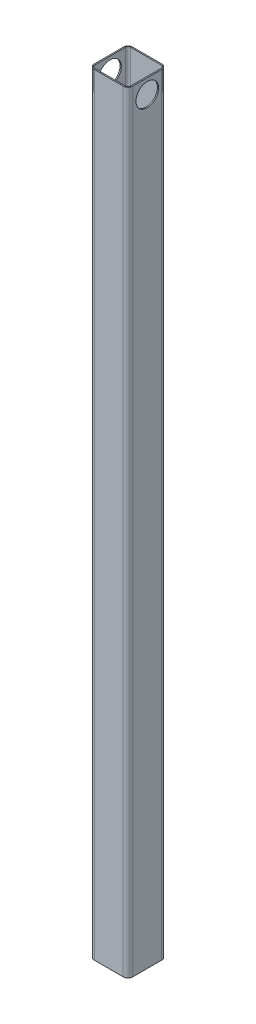
ISO-10303-21;
HEADER;
FILE_DESCRIPTION(('STEP AP214'),'2;1');
FILE_NAME('part.step','',(''),(''),'','','');
FILE_SCHEMA(('AUTOMOTIVE_DESIGN { 1 0 10303 214 1 1 1 1 }'));
ENDSEC;
DATA;
#1=APPLICATION_CONTEXT('core data for automotive mechanical design processes');
#2=APPLICATION_PROTOCOL_DEFINITION('international standard','automotive_design',2000,#1);
#3=PRODUCT_CONTEXT('',#1,'mechanical');
#4=PRODUCT('Part','Part','',(#3));
#5=PRODUCT_RELATED_PRODUCT_CATEGORY('part','',(#4));
#6=PRODUCT_DEFINITION_FORMATION('','',#4);
#7=PRODUCT_DEFINITION_CONTEXT('part definition',#1,'design');
#8=PRODUCT_DEFINITION('design','',#6,#7);
#9=PRODUCT_DEFINITION_SHAPE('','',#8);
#10=(LENGTH_UNIT() NAMED_UNIT(*) SI_UNIT(.MILLI.,.METRE.));
#11=(NAMED_UNIT(*) PLANE_ANGLE_UNIT() SI_UNIT($,.RADIAN.));
#12=(NAMED_UNIT(*) SI_UNIT($,.STERADIAN.) SOLID_ANGLE_UNIT());
#13=UNCERTAINTY_MEASURE_WITH_UNIT(LENGTH_MEASURE(1.E-05),#10,'distance_accuracy_value','');
#14=(GEOMETRIC_REPRESENTATION_CONTEXT(3) GLOBAL_UNCERTAINTY_ASSIGNED_CONTEXT((#13)) GLOBAL_UNIT_ASSIGNED_CONTEXT((#10,
#11,#12)) REPRESENTATION_CONTEXT('',''));
#15=CARTESIAN_POINT('',(0.,0.,0.));
#16=DIRECTION('',(0.,0.,1.));
#17=DIRECTION('',(1.,0.,0.));
#18=AXIS2_PLACEMENT_3D('',#15,#16,#17);
#19=CARTESIAN_POINT('',(28.575,762.,-28.575));
#20=DIRECTION('',(0.,1.,0.));
#21=DIRECTION('',(0.,0.,1.));
#22=AXIS2_PLACEMENT_3D('',#19,#20,#21);
#23=PLANE('',#22);
#24=CARTESIAN_POINT('',(28.575,762.,-28.575));
#25=DIRECTION('',(0.,1.,0.));
#26=DIRECTION('',(0.,0.,1.));
#27=AXIS2_PLACEMENT_3D('',#24,#25,#26);
#28=CIRCLE('',#27,9.525);
#29=CARTESIAN_POINT('',(38.1,762.,-28.575));
#30=VERTEX_POINT('',#29);
#31=CARTESIAN_POINT('',(28.575,762.,-38.1));
#32=VERTEX_POINT('',#31);
#33=EDGE_CURVE('E230',#30,#32,#28,.T.);
#34=ORIENTED_EDGE('',*,*,#33,.T.);
#35=DIRECTION('',(-1.,0.,0.));
#36=VECTOR('',#35,1.);
#37=CARTESIAN_POINT('',(28.575,762.,-38.1));
#38=LINE('',#37,#36);
#39=CARTESIAN_POINT('',(-28.575,762.,-38.1));
#40=VERTEX_POINT('',#39);
#41=EDGE_CURVE('E233',#32,#40,#38,.T.);
#42=ORIENTED_EDGE('',*,*,#41,.T.);
#43=CARTESIAN_POINT('',(-28.575,762.,-28.575));
#44=DIRECTION('',(0.,1.,0.));
#45=DIRECTION('',(0.,0.,1.));
#46=AXIS2_PLACEMENT_3D('',#43,#44,#45);
#47=CIRCLE('',#46,9.52499999999999);
#48=CARTESIAN_POINT('',(-38.1,762.,-28.575));
#49=VERTEX_POINT('',#48);
#50=EDGE_CURVE('E236',#40,#49,#47,.T.);
#51=ORIENTED_EDGE('',*,*,#50,.T.);
#52=DIRECTION('',(0.,0.,1.));
#53=VECTOR('',#52,1.);
#54=CARTESIAN_POINT('',(-38.1,762.,28.575));
#55=LINE('',#54,#53);
#56=CARTESIAN_POINT('',(-38.1,762.,28.575));
#57=VERTEX_POINT('',#56);
#58=EDGE_CURVE('E238',#49,#57,#55,.T.);
#59=ORIENTED_EDGE('',*,*,#58,.T.);
#60=CARTESIAN_POINT('',(-28.575,762.,28.575));
#61=DIRECTION('',(0.,1.,0.));
#62=DIRECTION('',(0.,0.,1.));
#63=AXIS2_PLACEMENT_3D('',#60,#61,#62);
#64=CIRCLE('',#63,9.525);
#65=CARTESIAN_POINT('',(-28.575,762.,38.1));
#66=VERTEX_POINT('',#65);
#67=EDGE_CURVE('E240',#57,#66,#64,.T.);
#68=ORIENTED_EDGE('',*,*,#67,.T.);
#69=DIRECTION('',(1.,0.,0.));
#70=VECTOR('',#69,1.);
#71=CARTESIAN_POINT('',(-28.575,762.,38.1));
#72=LINE('',#71,#70);
#73=CARTESIAN_POINT('',(28.575,762.,38.1));
#74=VERTEX_POINT('',#73);
#75=EDGE_CURVE('E242',#66,#74,#72,.T.);
#76=ORIENTED_EDGE('',*,*,#75,.T.);
#77=CARTESIAN_POINT('',(28.575,762.,28.575));
#78=DIRECTION('',(0.,1.,0.));
#79=DIRECTION('',(0.,0.,1.));
#80=AXIS2_PLACEMENT_3D('',#77,#78,#79);
#81=CIRCLE('',#80,9.525);
#82=CARTESIAN_POINT('',(38.1,762.,28.575));
#83=VERTEX_POINT('',#82);
#84=EDGE_CURVE('E244',#74,#83,#81,.T.);
#85=ORIENTED_EDGE('',*,*,#84,.T.);
#86=DIRECTION('',(0.,0.,-1.));
#87=VECTOR('',#86,1.);
#88=CARTESIAN_POINT('',(38.1,762.,-28.575));
#89=LINE('',#88,#87);
#90=EDGE_CURVE('E246',#83,#30,#89,.T.);
#91=ORIENTED_EDGE('',*,*,#90,.T.);
#92=EDGE_LOOP('',(#34,#42,#51,#59,#68,#76,#85,#91));
#93=FACE_BOUND('',#92,.T.);
#94=DIRECTION('',(0.,0.,1.));
#95=VECTOR('',#94,1.);
#96=CARTESIAN_POINT('',(-35.687,762.,30.9245));
#97=LINE('',#96,#95);
#98=CARTESIAN_POINT('',(-35.687,762.,-30.9245));
#99=VERTEX_POINT('',#98);
#100=CARTESIAN_POINT('',(-35.687,762.,30.9245));
#101=VERTEX_POINT('',#100);
#102=EDGE_CURVE('E163',#99,#101,#97,.T.);
#103=ORIENTED_EDGE('',*,*,#102,.F.);
#104=CARTESIAN_POINT('',(-30.9245,762.,-30.9245));
#105=DIRECTION('',(0.,1.,0.));
#106=DIRECTION('',(0.,0.,1.));
#107=AXIS2_PLACEMENT_3D('',#104,#105,#106);
#108=CIRCLE('',#107,4.7625);
#109=CARTESIAN_POINT('',(-30.9245,762.,-35.687));
#110=VERTEX_POINT('',#109);
#111=EDGE_CURVE('E155',#110,#99,#108,.T.);
#112=ORIENTED_EDGE('',*,*,#111,.F.);
#113=DIRECTION('',(-1.,0.,0.));
#114=VECTOR('',#113,1.);
#115=CARTESIAN_POINT('',(30.9245,762.,-35.687));
#116=LINE('',#115,#114);
#117=CARTESIAN_POINT('',(30.9245,762.,-35.687));
#118=VERTEX_POINT('',#117);
#119=EDGE_CURVE('E190',#118,#110,#116,.T.);
#120=ORIENTED_EDGE('',*,*,#119,.F.);
#121=CARTESIAN_POINT('',(30.9245,762.,-30.9245));
#122=DIRECTION('',(0.,1.,0.));
#123=DIRECTION('',(0.,0.,1.));
#124=AXIS2_PLACEMENT_3D('',#121,#122,#123);
#125=CIRCLE('',#124,4.7625);
#126=CARTESIAN_POINT('',(35.687,762.,-30.9245));
#127=VERTEX_POINT('',#126);
#128=EDGE_CURVE('E188',#127,#118,#125,.T.);
#129=ORIENTED_EDGE('',*,*,#128,.F.);
#130=DIRECTION('',(0.,0.,-1.));
#131=VECTOR('',#130,1.);
#132=CARTESIAN_POINT('',(35.687,762.,-30.9245));
#133=LINE('',#132,#131);
#134=CARTESIAN_POINT('',(35.687,762.,30.9245));
#135=VERTEX_POINT('',#134);
#136=EDGE_CURVE('E186',#135,#127,#133,.T.);
#137=ORIENTED_EDGE('',*,*,#136,.F.);
#138=CARTESIAN_POINT('',(30.9245,762.,30.9245));
#139=DIRECTION('',(0.,1.,0.));
#140=DIRECTION('',(0.,0.,1.));
#141=AXIS2_PLACEMENT_3D('',#138,#139,#140);
#142=CIRCLE('',#141,4.7625);
#143=CARTESIAN_POINT('',(30.9245,762.,35.687));
#144=VERTEX_POINT('',#143);
#145=EDGE_CURVE('E184',#144,#135,#142,.T.);
#146=ORIENTED_EDGE('',*,*,#145,.F.);
#147=DIRECTION('',(1.,0.,0.));
#148=VECTOR('',#147,1.);
#149=CARTESIAN_POINT('',(-30.9245,762.,35.687));
#150=LINE('',#149,#148);
#151=CARTESIAN_POINT('',(-30.9245,762.,35.687));
#152=VERTEX_POINT('',#151);
#153=EDGE_CURVE('E179',#152,#144,#150,.T.);
#154=ORIENTED_EDGE('',*,*,#153,.F.);
#155=CARTESIAN_POINT('',(-30.9245,762.,30.9245));
#156=DIRECTION('',(0.,1.,0.));
#157=DIRECTION('',(0.,0.,1.));
#158=AXIS2_PLACEMENT_3D('',#155,#156,#157);
#159=CIRCLE('',#158,4.7625);
#160=EDGE_CURVE('E177',#101,#152,#159,.T.);
#161=ORIENTED_EDGE('',*,*,#160,.F.);
#162=EDGE_LOOP('',(#103,#112,#120,#129,#137,#146,#154,#161));
#163=FACE_BOUND('',#162,.T.);
#164=ADVANCED_FACE('F40',(#93,#163),#23,.T.);
#165=CARTESIAN_POINT('',(28.575,-762.,-28.575));
#166=DIRECTION('',(0.,1.,0.));
#167=DIRECTION('',(0.,0.,1.));
#168=AXIS2_PLACEMENT_3D('',#165,#166,#167);
#169=PLANE('',#168);
#170=CARTESIAN_POINT('',(28.575,-762.,-28.575));
#171=DIRECTION('',(0.,1.,0.));
#172=DIRECTION('',(0.,0.,1.));
#173=AXIS2_PLACEMENT_3D('',#170,#171,#172);
#174=CIRCLE('',#173,9.525);
#175=CARTESIAN_POINT('',(38.1,-762.,-28.575));
#176=VERTEX_POINT('',#175);
#177=CARTESIAN_POINT('',(28.575,-762.,-38.1));
#178=VERTEX_POINT('',#177);
#179=EDGE_CURVE('E172',#176,#178,#174,.T.);
#180=ORIENTED_EDGE('',*,*,#179,.F.);
#181=DIRECTION('',(0.,0.,-1.));
#182=VECTOR('',#181,1.);
#183=CARTESIAN_POINT('',(38.1,-762.,-28.575));
#184=LINE('',#183,#182);
#185=CARTESIAN_POINT('',(38.1,-762.,28.575));
#186=VERTEX_POINT('',#185);
#187=EDGE_CURVE('E234',#186,#176,#184,.T.);
#188=ORIENTED_EDGE('',*,*,#187,.F.);
#189=CARTESIAN_POINT('',(28.575,-762.,28.575));
#190=DIRECTION('',(0.,1.,0.));
#191=DIRECTION('',(0.,0.,1.));
#192=AXIS2_PLACEMENT_3D('',#189,#190,#191);
#193=CIRCLE('',#192,9.525);
#194=CARTESIAN_POINT('',(28.575,-762.,38.1));
#195=VERTEX_POINT('',#194);
#196=EDGE_CURVE('E261',#195,#186,#193,.T.);
#197=ORIENTED_EDGE('',*,*,#196,.F.);
#198=DIRECTION('',(1.,0.,0.));
#199=VECTOR('',#198,1.);
#200=CARTESIAN_POINT('',(-28.575,-762.,38.1));
#201=LINE('',#200,#199);
#202=CARTESIAN_POINT('',(-28.575,-762.,38.1));
#203=VERTEX_POINT('',#202);
#204=EDGE_CURVE('E259',#203,#195,#201,.T.);
#205=ORIENTED_EDGE('',*,*,#204,.F.);
#206=CARTESIAN_POINT('',(-28.575,-762.,28.575));
#207=DIRECTION('',(0.,1.,0.));
#208=DIRECTION('',(0.,0.,1.));
#209=AXIS2_PLACEMENT_3D('',#206,#207,#208);
#210=CIRCLE('',#209,9.525);
#211=CARTESIAN_POINT('',(-38.1,-762.,28.575));
#212=VERTEX_POINT('',#211);
#213=EDGE_CURVE('E257',#212,#203,#210,.T.);
#214=ORIENTED_EDGE('',*,*,#213,.F.);
#215=DIRECTION('',(0.,0.,1.));
#216=VECTOR('',#215,1.);
#217=CARTESIAN_POINT('',(-38.1,-762.,28.575));
#218=LINE('',#217,#216);
#219=CARTESIAN_POINT('',(-38.1,-762.,-28.575));
#220=VERTEX_POINT('',#219);
#221=EDGE_CURVE('E255',#220,#212,#218,.T.);
#222=ORIENTED_EDGE('',*,*,#221,.F.);
#223=CARTESIAN_POINT('',(-28.575,-762.,-28.575));
#224=DIRECTION('',(0.,1.,0.));
#225=DIRECTION('',(0.,0.,1.));
#226=AXIS2_PLACEMENT_3D('',#223,#224,#225);
#227=CIRCLE('',#226,9.52499999999999);
#228=CARTESIAN_POINT('',(-28.575,-762.,-38.1));
#229=VERTEX_POINT('',#228);
#230=EDGE_CURVE('E253',#229,#220,#227,.T.);
#231=ORIENTED_EDGE('',*,*,#230,.F.);
#232=DIRECTION('',(-1.,0.,0.));
#233=VECTOR('',#232,1.);
#234=CARTESIAN_POINT('',(28.575,-762.,-38.1));
#235=LINE('',#234,#233);
#236=EDGE_CURVE('E251',#178,#229,#235,.T.);
#237=ORIENTED_EDGE('',*,*,#236,.F.);
#238=EDGE_LOOP('',(#180,#188,#197,#205,#214,#222,#231,#237));
#239=FACE_BOUND('',#238,.T.);
#240=CARTESIAN_POINT('',(-30.9245,-762.,-30.9245));
#241=DIRECTION('',(0.,1.,0.));
#242=DIRECTION('',(0.,0.,1.));
#243=AXIS2_PLACEMENT_3D('',#240,#241,#242);
#244=CIRCLE('',#243,4.7625);
#245=CARTESIAN_POINT('',(-30.9245,-762.,-35.687));
#246=VERTEX_POINT('',#245);
#247=CARTESIAN_POINT('',(-35.687,-762.,-30.9245));
#248=VERTEX_POINT('',#247);
#249=EDGE_CURVE('E65',#246,#248,#244,.T.);
#250=ORIENTED_EDGE('',*,*,#249,.T.);
#251=DIRECTION('',(0.,0.,1.));
#252=VECTOR('',#251,1.);
#253=CARTESIAN_POINT('',(-35.687,-762.,30.9245));
#254=LINE('',#253,#252);
#255=CARTESIAN_POINT('',(-35.687,-762.,30.9245));
#256=VERTEX_POINT('',#255);
#257=EDGE_CURVE('E170',#248,#256,#254,.T.);
#258=ORIENTED_EDGE('',*,*,#257,.T.);
#259=CARTESIAN_POINT('',(-30.9245,-762.,30.9245));
#260=DIRECTION('',(0.,1.,0.));
#261=DIRECTION('',(0.,0.,1.));
#262=AXIS2_PLACEMENT_3D('',#259,#260,#261);
#263=CIRCLE('',#262,4.7625);
#264=CARTESIAN_POINT('',(-30.9245,-762.,35.687));
#265=VERTEX_POINT('',#264);
#266=EDGE_CURVE('E195',#256,#265,#263,.T.);
#267=ORIENTED_EDGE('',*,*,#266,.T.);
#268=DIRECTION('',(1.,0.,0.));
#269=VECTOR('',#268,1.);
#270=CARTESIAN_POINT('',(-30.9245,-762.,35.687));
#271=LINE('',#270,#269);
#272=CARTESIAN_POINT('',(30.9245,-762.,35.687));
#273=VERTEX_POINT('',#272);
#274=EDGE_CURVE('E198',#265,#273,#271,.T.);
#275=ORIENTED_EDGE('',*,*,#274,.T.);
#276=CARTESIAN_POINT('',(30.9245,-762.,30.9245));
#277=DIRECTION('',(0.,1.,0.));
#278=DIRECTION('',(0.,0.,1.));
#279=AXIS2_PLACEMENT_3D('',#276,#277,#278);
#280=CIRCLE('',#279,4.7625);
#281=CARTESIAN_POINT('',(35.687,-762.,30.9245));
#282=VERTEX_POINT('',#281);
#283=EDGE_CURVE('E201',#273,#282,#280,.T.);
#284=ORIENTED_EDGE('',*,*,#283,.T.);
#285=DIRECTION('',(0.,0.,-1.));
#286=VECTOR('',#285,1.);
#287=CARTESIAN_POINT('',(35.687,-762.,-30.9245));
#288=LINE('',#287,#286);
#289=CARTESIAN_POINT('',(35.687,-762.,-30.9245));
#290=VERTEX_POINT('',#289);
#291=EDGE_CURVE('E204',#282,#290,#288,.T.);
#292=ORIENTED_EDGE('',*,*,#291,.T.);
#293=CARTESIAN_POINT('',(30.9245,-762.,-30.9245));
#294=DIRECTION('',(0.,1.,0.));
#295=DIRECTION('',(0.,0.,1.));
#296=AXIS2_PLACEMENT_3D('',#293,#294,#295);
#297=CIRCLE('',#296,4.7625);
#298=CARTESIAN_POINT('',(30.9245,-762.,-35.687));
#299=VERTEX_POINT('',#298);
#300=EDGE_CURVE('E207',#290,#299,#297,.T.);
#301=ORIENTED_EDGE('',*,*,#300,.T.);
#302=DIRECTION('',(-1.,0.,0.));
#303=VECTOR('',#302,1.);
#304=CARTESIAN_POINT('',(30.9245,-762.,-35.687));
#305=LINE('',#304,#303);
#306=EDGE_CURVE('E164',#299,#246,#305,.T.);
#307=ORIENTED_EDGE('',*,*,#306,.T.);
#308=EDGE_LOOP('',(#250,#258,#267,#275,#284,#292,#301,#307));
#309=FACE_BOUND('',#308,.T.);
#310=ADVANCED_FACE('F299',(#239,#309),#169,.F.);
#311=CARTESIAN_POINT('',(28.575,762.,-28.575));
#312=DIRECTION('',(0.,-1.,0.));
#313=DIRECTION('',(0.,0.,-1.));
#314=AXIS2_PLACEMENT_3D('',#311,#312,#313);
#315=CYLINDRICAL_SURFACE('',#314,9.525);
#316=ORIENTED_EDGE('',*,*,#179,.T.);
#317=DIRECTION('',(0.,-1.,0.));
#318=VECTOR('',#317,1.);
#319=CARTESIAN_POINT('',(28.575,762.,-38.1));
#320=LINE('',#319,#318);
#321=EDGE_CURVE('E11',#32,#178,#320,.T.);
#322=ORIENTED_EDGE('',*,*,#321,.F.);
#323=ORIENTED_EDGE('',*,*,#33,.F.);
#324=DIRECTION('',(0.,-1.,0.));
#325=VECTOR('',#324,1.);
#326=CARTESIAN_POINT('',(38.1,762.,-28.575));
#327=LINE('',#326,#325);
#328=EDGE_CURVE('E248',#30,#176,#327,.T.);
#329=ORIENTED_EDGE('',*,*,#328,.T.);
#330=EDGE_LOOP('',(#316,#322,#323,#329));
#331=FACE_BOUND('',#330,.T.);
#332=ADVANCED_FACE('F42',(#331),#315,.T.);
#333=CARTESIAN_POINT('',(28.575,762.,-38.1));
#334=DIRECTION('',(0.,0.,1.));
#335=DIRECTION('',(1.,0.,0.));
#336=AXIS2_PLACEMENT_3D('',#333,#334,#335);
#337=PLANE('',#336);
#338=ORIENTED_EDGE('',*,*,#236,.T.);
#339=DIRECTION('',(0.,-1.,0.));
#340=VECTOR('',#339,1.);
#341=CARTESIAN_POINT('',(-28.575,762.,-38.1));
#342=LINE('',#341,#340);
#343=EDGE_CURVE('E50',#40,#229,#342,.T.);
#344=ORIENTED_EDGE('',*,*,#343,.F.);
#345=ORIENTED_EDGE('',*,*,#41,.F.);
#346=ORIENTED_EDGE('',*,*,#321,.T.);
#347=EDGE_LOOP('',(#338,#344,#345,#346));
#348=FACE_BOUND('',#347,.T.);
#349=ADVANCED_FACE('F316',(#348),#337,.F.);
#350=CARTESIAN_POINT('',(-28.575,762.,-28.575));
#351=DIRECTION('',(0.,-1.,0.));
#352=DIRECTION('',(0.,0.,-1.));
#353=AXIS2_PLACEMENT_3D('',#350,#351,#352);
#354=CYLINDRICAL_SURFACE('',#353,9.52499999999999);
#355=ORIENTED_EDGE('',*,*,#230,.T.);
#356=DIRECTION('',(0.,-1.,0.));
#357=VECTOR('',#356,1.);
#358=CARTESIAN_POINT('',(-38.1,762.,-28.575));
#359=LINE('',#358,#357);
#360=EDGE_CURVE('E283',#49,#220,#359,.T.);
#361=ORIENTED_EDGE('',*,*,#360,.F.);
#362=ORIENTED_EDGE('',*,*,#50,.F.);
#363=ORIENTED_EDGE('',*,*,#343,.T.);
#364=EDGE_LOOP('',(#355,#361,#362,#363));
#365=FACE_BOUND('',#364,.T.);
#366=ADVANCED_FACE('F293',(#365),#354,.T.);
#367=CARTESIAN_POINT('',(-38.1,762.,28.575));
#368=DIRECTION('',(1.,0.,0.));
#369=DIRECTION('',(0.,0.,-1.));
#370=AXIS2_PLACEMENT_3D('',#367,#368,#369);
#371=PLANE('',#370);
#372=CARTESIAN_POINT('',(-38.1,733.171,0.));
#373=DIRECTION('',(1.,0.,0.));
#374=DIRECTION('',(0.,0.,-1.));
#375=AXIS2_PLACEMENT_3D('',#372,#373,#374);
#376=CIRCLE('',#375,22.479);
#377=CARTESIAN_POINT('',(-38.1,733.171,-22.479));
#378=VERTEX_POINT('',#377);
#379=EDGE_CURVE('E356',#378,#378,#376,.T.);
#380=ORIENTED_EDGE('',*,*,#379,.T.);
#381=EDGE_LOOP('',(#380));
#382=FACE_BOUND('',#381,.T.);
#383=ORIENTED_EDGE('',*,*,#221,.T.);
#384=DIRECTION('',(0.,-1.,0.));
#385=VECTOR('',#384,1.);
#386=CARTESIAN_POINT('',(-38.1,762.,28.575));
#387=LINE('',#386,#385);
#388=EDGE_CURVE('E279',#57,#212,#387,.T.);
#389=ORIENTED_EDGE('',*,*,#388,.F.);
#390=ORIENTED_EDGE('',*,*,#58,.F.);
#391=ORIENTED_EDGE('',*,*,#360,.T.);
#392=EDGE_LOOP('',(#383,#389,#390,#391));
#393=FACE_BOUND('',#392,.T.);
#394=ADVANCED_FACE('F305',(#382,#393),#371,.F.);
#395=CARTESIAN_POINT('',(-28.575,762.,28.575));
#396=DIRECTION('',(0.,-1.,0.));
#397=DIRECTION('',(0.,0.,-1.));
#398=AXIS2_PLACEMENT_3D('',#395,#396,#397);
#399=CYLINDRICAL_SURFACE('',#398,9.525);
#400=ORIENTED_EDGE('',*,*,#213,.T.);
#401=DIRECTION('',(0.,-1.,0.));
#402=VECTOR('',#401,1.);
#403=CARTESIAN_POINT('',(-28.575,762.,38.1));
#404=LINE('',#403,#402);
#405=EDGE_CURVE('E275',#66,#203,#404,.T.);
#406=ORIENTED_EDGE('',*,*,#405,.F.);
#407=ORIENTED_EDGE('',*,*,#67,.F.);
#408=ORIENTED_EDGE('',*,*,#388,.T.);
#409=EDGE_LOOP('',(#400,#406,#407,#408));
#410=FACE_BOUND('',#409,.T.);
#411=ADVANCED_FACE('F309',(#410),#399,.T.);
#412=CARTESIAN_POINT('',(-28.575,762.,38.1));
#413=DIRECTION('',(0.,0.,-1.));
#414=DIRECTION('',(-1.,0.,0.));
#415=AXIS2_PLACEMENT_3D('',#412,#413,#414);
#416=PLANE('',#415);
#417=ORIENTED_EDGE('',*,*,#204,.T.);
#418=DIRECTION('',(0.,-1.,0.));
#419=VECTOR('',#418,1.);
#420=CARTESIAN_POINT('',(28.575,762.,38.1));
#421=LINE('',#420,#419);
#422=EDGE_CURVE('E271',#74,#195,#421,.T.);
#423=ORIENTED_EDGE('',*,*,#422,.F.);
#424=ORIENTED_EDGE('',*,*,#75,.F.);
#425=ORIENTED_EDGE('',*,*,#405,.T.);
#426=EDGE_LOOP('',(#417,#423,#424,#425));
#427=FACE_BOUND('',#426,.T.);
#428=ADVANCED_FACE('F329',(#427),#416,.F.);
#429=CARTESIAN_POINT('',(28.575,762.,28.575));
#430=DIRECTION('',(0.,-1.,0.));
#431=DIRECTION('',(0.,0.,-1.));
#432=AXIS2_PLACEMENT_3D('',#429,#430,#431);
#433=CYLINDRICAL_SURFACE('',#432,9.525);
#434=ORIENTED_EDGE('',*,*,#196,.T.);
#435=DIRECTION('',(0.,-1.,0.));
#436=VECTOR('',#435,1.);
#437=CARTESIAN_POINT('',(38.1,762.,28.575));
#438=LINE('',#437,#436);
#439=EDGE_CURVE('E267',#83,#186,#438,.T.);
#440=ORIENTED_EDGE('',*,*,#439,.F.);
#441=ORIENTED_EDGE('',*,*,#84,.F.);
#442=ORIENTED_EDGE('',*,*,#422,.T.);
#443=EDGE_LOOP('',(#434,#440,#441,#442));
#444=FACE_BOUND('',#443,.T.);
#445=ADVANCED_FACE('F327',(#444),#433,.T.);
#446=CARTESIAN_POINT('',(38.1,762.,-28.575));
#447=DIRECTION('',(-1.,0.,0.));
#448=DIRECTION('',(0.,0.,1.));
#449=AXIS2_PLACEMENT_3D('',#446,#447,#448);
#450=PLANE('',#449);
#451=CARTESIAN_POINT('',(38.1,733.171,0.));
#452=DIRECTION('',(1.,0.,0.));
#453=DIRECTION('',(0.,0.,-1.));
#454=AXIS2_PLACEMENT_3D('',#451,#452,#453);
#455=CIRCLE('',#454,22.479);
#456=CARTESIAN_POINT('',(38.1,733.171,-22.479));
#457=VERTEX_POINT('',#456);
#458=EDGE_CURVE('E354',#457,#457,#455,.T.);
#459=ORIENTED_EDGE('',*,*,#458,.F.);
#460=EDGE_LOOP('',(#459));
#461=FACE_BOUND('',#460,.T.);
#462=ORIENTED_EDGE('',*,*,#187,.T.);
#463=ORIENTED_EDGE('',*,*,#328,.F.);
#464=ORIENTED_EDGE('',*,*,#90,.F.);
#465=ORIENTED_EDGE('',*,*,#439,.T.);
#466=EDGE_LOOP('',(#462,#463,#464,#465));
#467=FACE_BOUND('',#466,.T.);
#468=ADVANCED_FACE('F322',(#461,#467),#450,.F.);
#469=CARTESIAN_POINT('',(-30.9245,762.,-30.9245));
#470=DIRECTION('',(0.,-1.,0.));
#471=DIRECTION('',(0.,0.,-1.));
#472=AXIS2_PLACEMENT_3D('',#469,#470,#471);
#473=CYLINDRICAL_SURFACE('',#472,4.7625);
#474=ORIENTED_EDGE('',*,*,#249,.F.);
#475=DIRECTION('',(0.,-1.,0.));
#476=VECTOR('',#475,1.);
#477=CARTESIAN_POINT('',(-30.9245,762.,-35.687));
#478=LINE('',#477,#476);
#479=EDGE_CURVE('E159',#110,#246,#478,.T.);
#480=ORIENTED_EDGE('',*,*,#479,.F.);
#481=ORIENTED_EDGE('',*,*,#111,.T.);
#482=DIRECTION('',(0.,-1.,0.));
#483=VECTOR('',#482,1.);
#484=CARTESIAN_POINT('',(-35.687,762.,-30.9245));
#485=LINE('',#484,#483);
#486=EDGE_CURVE('E158',#99,#248,#485,.T.);
#487=ORIENTED_EDGE('',*,*,#486,.T.);
#488=EDGE_LOOP('',(#474,#480,#481,#487));
#489=FACE_BOUND('',#488,.T.);
#490=ADVANCED_FACE('F157',(#489),#473,.F.);
#491=CARTESIAN_POINT('',(-35.687,762.,30.9245));
#492=DIRECTION('',(1.,0.,0.));
#493=DIRECTION('',(0.,0.,-1.));
#494=AXIS2_PLACEMENT_3D('',#491,#492,#493);
#495=PLANE('',#494);
#496=CARTESIAN_POINT('',(-35.687,733.171,0.));
#497=DIRECTION('',(1.,0.,0.));
#498=DIRECTION('',(0.,0.,-1.));
#499=AXIS2_PLACEMENT_3D('',#496,#497,#498);
#500=CIRCLE('',#499,22.479);
#501=CARTESIAN_POINT('',(-35.687,733.171,-22.479));
#502=VERTEX_POINT('',#501);
#503=EDGE_CURVE('E193',#502,#502,#500,.T.);
#504=ORIENTED_EDGE('',*,*,#503,.F.);
#505=EDGE_LOOP('',(#504));
#506=FACE_BOUND('',#505,.T.);
#507=ORIENTED_EDGE('',*,*,#257,.F.);
#508=ORIENTED_EDGE('',*,*,#486,.F.);
#509=ORIENTED_EDGE('',*,*,#102,.T.);
#510=DIRECTION('',(0.,-1.,0.));
#511=VECTOR('',#510,1.);
#512=CARTESIAN_POINT('',(-35.687,762.,30.9245));
#513=LINE('',#512,#511);
#514=EDGE_CURVE('E173',#101,#256,#513,.T.);
#515=ORIENTED_EDGE('',*,*,#514,.T.);
#516=EDGE_LOOP('',(#507,#508,#509,#515));
#517=FACE_BOUND('',#516,.T.);
#518=ADVANCED_FACE('F167',(#506,#517),#495,.T.);
#519=CARTESIAN_POINT('',(-30.9245,762.,30.9245));
#520=DIRECTION('',(0.,-1.,0.));
#521=DIRECTION('',(0.,0.,-1.));
#522=AXIS2_PLACEMENT_3D('',#519,#520,#521);
#523=CYLINDRICAL_SURFACE('',#522,4.7625);
#524=ORIENTED_EDGE('',*,*,#266,.F.);
#525=ORIENTED_EDGE('',*,*,#514,.F.);
#526=ORIENTED_EDGE('',*,*,#160,.T.);
#527=DIRECTION('',(0.,-1.,0.));
#528=VECTOR('',#527,1.);
#529=CARTESIAN_POINT('',(-30.9245,762.,35.687));
#530=LINE('',#529,#528);
#531=EDGE_CURVE('E225',#152,#265,#530,.T.);
#532=ORIENTED_EDGE('',*,*,#531,.T.);
#533=EDGE_LOOP('',(#524,#525,#526,#532));
#534=FACE_BOUND('',#533,.T.);
#535=ADVANCED_FACE('F404',(#534),#523,.F.);
#536=CARTESIAN_POINT('',(-30.9245,762.,35.687));
#537=DIRECTION('',(0.,0.,-1.));
#538=DIRECTION('',(-1.,0.,0.));
#539=AXIS2_PLACEMENT_3D('',#536,#537,#538);
#540=PLANE('',#539);
#541=ORIENTED_EDGE('',*,*,#274,.F.);
#542=ORIENTED_EDGE('',*,*,#531,.F.);
#543=ORIENTED_EDGE('',*,*,#153,.T.);
#544=DIRECTION('',(0.,-1.,0.));
#545=VECTOR('',#544,1.);
#546=CARTESIAN_POINT('',(30.9245,762.,35.687));
#547=LINE('',#546,#545);
#548=EDGE_CURVE('E222',#144,#273,#547,.T.);
#549=ORIENTED_EDGE('',*,*,#548,.T.);
#550=EDGE_LOOP('',(#541,#542,#543,#549));
#551=FACE_BOUND('',#550,.T.);
#552=ADVANCED_FACE('F401',(#551),#540,.T.);
#553=CARTESIAN_POINT('',(30.9245,762.,30.9245));
#554=DIRECTION('',(0.,-1.,0.));
#555=DIRECTION('',(0.,0.,-1.));
#556=AXIS2_PLACEMENT_3D('',#553,#554,#555);
#557=CYLINDRICAL_SURFACE('',#556,4.7625);
#558=ORIENTED_EDGE('',*,*,#283,.F.);
#559=ORIENTED_EDGE('',*,*,#548,.F.);
#560=ORIENTED_EDGE('',*,*,#145,.T.);
#561=DIRECTION('',(0.,-1.,0.));
#562=VECTOR('',#561,1.);
#563=CARTESIAN_POINT('',(35.687,762.,30.9245));
#564=LINE('',#563,#562);
#565=EDGE_CURVE('E219',#135,#282,#564,.T.);
#566=ORIENTED_EDGE('',*,*,#565,.T.);
#567=EDGE_LOOP('',(#558,#559,#560,#566));
#568=FACE_BOUND('',#567,.T.);
#569=ADVANCED_FACE('F374',(#568),#557,.F.);
#570=CARTESIAN_POINT('',(35.687,762.,-30.9245));
#571=DIRECTION('',(-1.,0.,0.));
#572=DIRECTION('',(0.,0.,1.));
#573=AXIS2_PLACEMENT_3D('',#570,#571,#572);
#574=PLANE('',#573);
#575=CARTESIAN_POINT('',(35.687,733.171,0.));
#576=DIRECTION('',(-1.,0.,0.));
#577=DIRECTION('',(0.,0.,1.));
#578=AXIS2_PLACEMENT_3D('',#575,#576,#577);
#579=CIRCLE('',#578,22.479);
#580=CARTESIAN_POINT('',(35.687,733.171,22.479));
#581=VERTEX_POINT('',#580);
#582=EDGE_CURVE('E44',#581,#581,#579,.T.);
#583=ORIENTED_EDGE('',*,*,#582,.F.);
#584=EDGE_LOOP('',(#583));
#585=FACE_BOUND('',#584,.T.);
#586=ORIENTED_EDGE('',*,*,#291,.F.);
#587=ORIENTED_EDGE('',*,*,#565,.F.);
#588=ORIENTED_EDGE('',*,*,#136,.T.);
#589=DIRECTION('',(0.,-1.,0.));
#590=VECTOR('',#589,1.);
#591=CARTESIAN_POINT('',(35.687,762.,-30.9245));
#592=LINE('',#591,#590);
#593=EDGE_CURVE('E216',#127,#290,#592,.T.);
#594=ORIENTED_EDGE('',*,*,#593,.T.);
#595=EDGE_LOOP('',(#586,#587,#588,#594));
#596=FACE_BOUND('',#595,.T.);
#597=ADVANCED_FACE('F370',(#585,#596),#574,.T.);
#598=CARTESIAN_POINT('',(30.9245,762.,-30.9245));
#599=DIRECTION('',(0.,-1.,0.));
#600=DIRECTION('',(0.,0.,-1.));
#601=AXIS2_PLACEMENT_3D('',#598,#599,#600);
#602=CYLINDRICAL_SURFACE('',#601,4.7625);
#603=ORIENTED_EDGE('',*,*,#300,.F.);
#604=ORIENTED_EDGE('',*,*,#593,.F.);
#605=ORIENTED_EDGE('',*,*,#128,.T.);
#606=DIRECTION('',(0.,-1.,0.));
#607=VECTOR('',#606,1.);
#608=CARTESIAN_POINT('',(30.9245,762.,-35.687));
#609=LINE('',#608,#607);
#610=EDGE_CURVE('E57',#118,#299,#609,.T.);
#611=ORIENTED_EDGE('',*,*,#610,.T.);
#612=EDGE_LOOP('',(#603,#604,#605,#611));
#613=FACE_BOUND('',#612,.T.);
#614=ADVANCED_FACE('F373',(#613),#602,.F.);
#615=CARTESIAN_POINT('',(30.9245,762.,-35.687));
#616=DIRECTION('',(0.,0.,1.));
#617=DIRECTION('',(1.,0.,0.));
#618=AXIS2_PLACEMENT_3D('',#615,#616,#617);
#619=PLANE('',#618);
#620=ORIENTED_EDGE('',*,*,#306,.F.);
#621=ORIENTED_EDGE('',*,*,#610,.F.);
#622=ORIENTED_EDGE('',*,*,#119,.T.);
#623=ORIENTED_EDGE('',*,*,#479,.T.);
#624=EDGE_LOOP('',(#620,#621,#622,#623));
#625=FACE_BOUND('',#624,.T.);
#626=ADVANCED_FACE('F388',(#625),#619,.T.);
#627=CARTESIAN_POINT('',(-38.1,733.171,0.));
#628=DIRECTION('',(1.,0.,0.));
#629=DIRECTION('',(0.,0.,-1.));
#630=AXIS2_PLACEMENT_3D('',#627,#628,#629);
#631=CYLINDRICAL_SURFACE('',#630,22.479);
#632=ORIENTED_EDGE('',*,*,#582,.T.);
#633=EDGE_LOOP('',(#632));
#634=FACE_BOUND('',#633,.T.);
#635=ORIENTED_EDGE('',*,*,#458,.T.);
#636=EDGE_LOOP('',(#635));
#637=FACE_BOUND('',#636,.T.);
#638=ADVANCED_FACE('F368',(#634,#637),#631,.F.);
#639=ORIENTED_EDGE('',*,*,#503,.T.);
#640=EDGE_LOOP('',(#639));
#641=FACE_BOUND('',#640,.T.);
#642=ORIENTED_EDGE('',*,*,#379,.F.);
#643=EDGE_LOOP('',(#642));
#644=FACE_BOUND('',#643,.T.);
#645=ADVANCED_FACE('F395',(#641,#644),#631,.F.);
#646=CLOSED_SHELL('',(#164,#310,#332,#349,#366,#394,#411,#428,#445,#468,#490,#518,#535,#552,
#569,#597,#614,#626,#638,#645));
#647=MANIFOLD_SOLID_BREP('B2',#646);
#648=ADVANCED_BREP_SHAPE_REPRESENTATION('',(#18,#647),#14);
#649=SHAPE_DEFINITION_REPRESENTATION(#9,#648);
ENDSEC;
END-ISO-10303-21;
